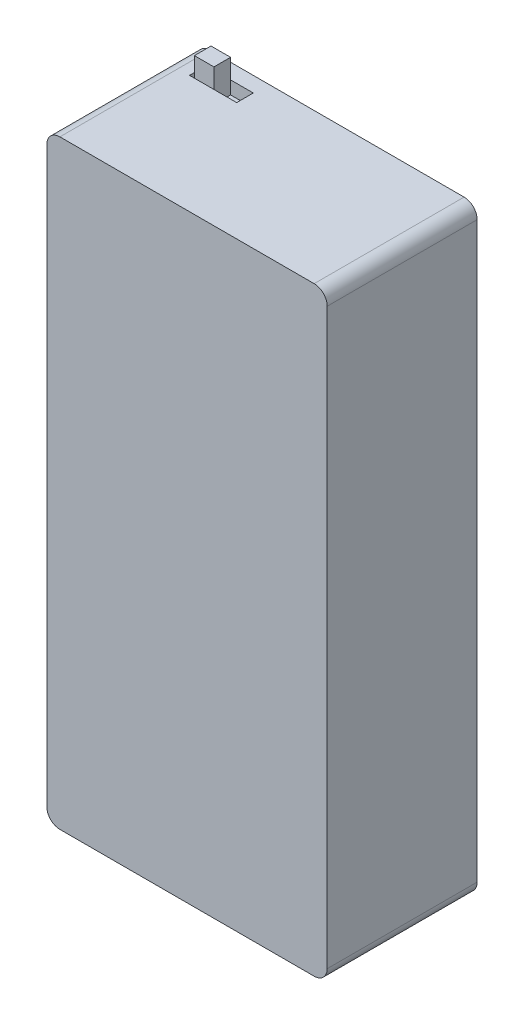
ISO-10303-21;
HEADER;
FILE_DESCRIPTION(('STEP AP214'),'2;1');
FILE_NAME('part.step','',(''),(''),'','','');
FILE_SCHEMA(('AUTOMOTIVE_DESIGN { 1 0 10303 214 1 1 1 1 }'));
ENDSEC;
DATA;
#1=APPLICATION_CONTEXT('core data for automotive mechanical design processes');
#2=APPLICATION_PROTOCOL_DEFINITION('international standard','automotive_design',2000,#1);
#3=PRODUCT_CONTEXT('',#1,'mechanical');
#4=PRODUCT('Part','Part','',(#3));
#5=PRODUCT_RELATED_PRODUCT_CATEGORY('part','',(#4));
#6=PRODUCT_DEFINITION_FORMATION('','',#4);
#7=PRODUCT_DEFINITION_CONTEXT('part definition',#1,'design');
#8=PRODUCT_DEFINITION('design','',#6,#7);
#9=PRODUCT_DEFINITION_SHAPE('','',#8);
#10=(LENGTH_UNIT() NAMED_UNIT(*) SI_UNIT(.MILLI.,.METRE.));
#11=(NAMED_UNIT(*) PLANE_ANGLE_UNIT() SI_UNIT($,.RADIAN.));
#12=(NAMED_UNIT(*) SI_UNIT($,.STERADIAN.) SOLID_ANGLE_UNIT());
#13=UNCERTAINTY_MEASURE_WITH_UNIT(LENGTH_MEASURE(1.E-05),#10,'distance_accuracy_value','');
#14=(GEOMETRIC_REPRESENTATION_CONTEXT(3) GLOBAL_UNCERTAINTY_ASSIGNED_CONTEXT((#13)) GLOBAL_UNIT_ASSIGNED_CONTEXT((#10,
#11,#12)) REPRESENTATION_CONTEXT('',''));
#15=CARTESIAN_POINT('',(0.,0.,0.));
#16=DIRECTION('',(0.,0.,1.));
#17=DIRECTION('',(1.,0.,0.));
#18=AXIS2_PLACEMENT_3D('',#15,#16,#17);
#19=CARTESIAN_POINT('',(3.77161647749301,90.,2.34243370889559));
#20=DIRECTION('',(0.,0.,-1.));
#21=DIRECTION('',(-1.,0.,0.));
#22=AXIS2_PLACEMENT_3D('',#19,#20,#21);
#23=PLANE('',#22);
#24=DIRECTION('',(0.,-1.,0.));
#25=VECTOR('',#24,1.);
#26=CARTESIAN_POINT('',(4.5196674747469,95.,2.34243370889559));
#27=LINE('',#26,#25);
#28=CARTESIAN_POINT('',(4.5196674747469,92.,2.34243370889559));
#29=VERTEX_POINT('',#28);
#30=CARTESIAN_POINT('',(4.5196674747469,90.,2.34243370889559));
#31=VERTEX_POINT('',#30);
#32=EDGE_CURVE('E533',#29,#31,#27,.T.);
#33=ORIENTED_EDGE('',*,*,#32,.F.);
#34=DIRECTION('',(-1.,0.,0.));
#35=VECTOR('',#34,1.);
#36=CARTESIAN_POINT('',(3.77161647749301,92.,2.34243370889559));
#37=LINE('',#36,#35);
#38=CARTESIAN_POINT('',(3.77161647749301,92.,2.34243370889559));
#39=VERTEX_POINT('',#38);
#40=EDGE_CURVE('E222',#29,#39,#37,.T.);
#41=ORIENTED_EDGE('',*,*,#40,.T.);
#42=DIRECTION('',(0.,1.,0.));
#43=VECTOR('',#42,1.);
#44=CARTESIAN_POINT('',(3.77161647749301,90.,2.34243370889559));
#45=LINE('',#44,#43);
#46=CARTESIAN_POINT('',(3.77161647749301,90.,2.34243370889559));
#47=VERTEX_POINT('',#46);
#48=EDGE_CURVE('E225',#47,#39,#45,.T.);
#49=ORIENTED_EDGE('',*,*,#48,.F.);
#50=DIRECTION('',(-1.,0.,0.));
#51=VECTOR('',#50,1.);
#52=CARTESIAN_POINT('',(3.77161647749301,90.,2.34243370889559));
#53=LINE('',#52,#51);
#54=EDGE_CURVE('E209',#31,#47,#53,.T.);
#55=ORIENTED_EDGE('',*,*,#54,.F.);
#56=EDGE_LOOP('',(#33,#41,#49,#55));
#57=FACE_BOUND('',#56,.T.);
#58=ADVANCED_FACE('F39',(#57),#23,.F.);
#59=DIRECTION('',(0.,-1.,0.));
#60=VECTOR('',#59,1.);
#61=CARTESIAN_POINT('',(7.5196674747469,95.,2.34243370889559));
#62=LINE('',#61,#60);
#63=CARTESIAN_POINT('',(7.5196674747469,92.,2.34243370889559));
#64=VERTEX_POINT('',#63);
#65=CARTESIAN_POINT('',(7.5196674747469,90.,2.34243370889559));
#66=VERTEX_POINT('',#65);
#67=EDGE_CURVE('E540',#64,#66,#62,.T.);
#68=ORIENTED_EDGE('',*,*,#67,.T.);
#69=CARTESIAN_POINT('',(11.0052712926965,90.,2.34243370889559));
#70=VERTEX_POINT('',#69);
#71=EDGE_CURVE('E210',#70,#66,#53,.T.);
#72=ORIENTED_EDGE('',*,*,#71,.F.);
#73=DIRECTION('',(0.,1.,0.));
#74=VECTOR('',#73,1.);
#75=CARTESIAN_POINT('',(11.0052712926965,90.,2.34243370889559));
#76=LINE('',#75,#74);
#77=CARTESIAN_POINT('',(11.0052712926965,92.,2.34243370889559));
#78=VERTEX_POINT('',#77);
#79=EDGE_CURVE('E228',#70,#78,#76,.T.);
#80=ORIENTED_EDGE('',*,*,#79,.T.);
#81=EDGE_CURVE('E202',#78,#64,#37,.T.);
#82=ORIENTED_EDGE('',*,*,#81,.T.);
#83=EDGE_LOOP('',(#68,#72,#80,#82));
#84=FACE_BOUND('',#83,.T.);
#85=ADVANCED_FACE('F335',(#84),#23,.F.);
#86=CARTESIAN_POINT('',(3.77161647749301,90.,4.89200056999192));
#87=DIRECTION('',(0.,0.,1.));
#88=DIRECTION('',(1.,0.,0.));
#89=AXIS2_PLACEMENT_3D('',#86,#87,#88);
#90=PLANE('',#89);
#91=DIRECTION('',(0.,-1.,0.));
#92=VECTOR('',#91,1.);
#93=CARTESIAN_POINT('',(4.5196674747469,95.,4.89200056999192));
#94=LINE('',#93,#92);
#95=CARTESIAN_POINT('',(4.5196674747469,92.,4.89200056999192));
#96=VERTEX_POINT('',#95);
#97=CARTESIAN_POINT('',(4.5196674747469,90.,4.89200056999192));
#98=VERTEX_POINT('',#97);
#99=EDGE_CURVE('E189',#96,#98,#94,.T.);
#100=ORIENTED_EDGE('',*,*,#99,.T.);
#101=DIRECTION('',(1.,0.,0.));
#102=VECTOR('',#101,1.);
#103=CARTESIAN_POINT('',(3.77161647749301,90.,4.89200056999192));
#104=LINE('',#103,#102);
#105=CARTESIAN_POINT('',(3.77161647749301,90.,4.89200056999192));
#106=VERTEX_POINT('',#105);
#107=EDGE_CURVE('E203',#106,#98,#104,.T.);
#108=ORIENTED_EDGE('',*,*,#107,.F.);
#109=DIRECTION('',(0.,1.,0.));
#110=VECTOR('',#109,1.);
#111=CARTESIAN_POINT('',(3.77161647749301,90.,4.89200056999192));
#112=LINE('',#111,#110);
#113=CARTESIAN_POINT('',(3.77161647749301,92.,4.89200056999192));
#114=VERTEX_POINT('',#113);
#115=EDGE_CURVE('E213',#106,#114,#112,.T.);
#116=ORIENTED_EDGE('',*,*,#115,.T.);
#117=DIRECTION('',(1.,0.,0.));
#118=VECTOR('',#117,1.);
#119=CARTESIAN_POINT('',(3.77161647749301,92.,4.89200056999192));
#120=LINE('',#119,#118);
#121=EDGE_CURVE('E216',#114,#96,#120,.T.);
#122=ORIENTED_EDGE('',*,*,#121,.T.);
#123=EDGE_LOOP('',(#100,#108,#116,#122));
#124=FACE_BOUND('',#123,.T.);
#125=ADVANCED_FACE('F341',(#124),#90,.F.);
#126=DIRECTION('',(0.,-1.,0.));
#127=VECTOR('',#126,1.);
#128=CARTESIAN_POINT('',(7.5196674747469,95.,4.89200056999192));
#129=LINE('',#128,#127);
#130=CARTESIAN_POINT('',(7.5196674747469,92.,4.89200056999192));
#131=VERTEX_POINT('',#130);
#132=CARTESIAN_POINT('',(7.5196674747469,90.,4.89200056999192));
#133=VERTEX_POINT('',#132);
#134=EDGE_CURVE('E54',#131,#133,#129,.T.);
#135=ORIENTED_EDGE('',*,*,#134,.F.);
#136=CARTESIAN_POINT('',(11.0052712926965,92.,4.89200056999192));
#137=VERTEX_POINT('',#136);
#138=EDGE_CURVE('E215',#131,#137,#120,.T.);
#139=ORIENTED_EDGE('',*,*,#138,.T.);
#140=DIRECTION('',(0.,1.,0.));
#141=VECTOR('',#140,1.);
#142=CARTESIAN_POINT('',(11.0052712926965,90.,4.89200056999192));
#143=LINE('',#142,#141);
#144=CARTESIAN_POINT('',(11.0052712926965,90.,4.89200056999192));
#145=VERTEX_POINT('',#144);
#146=EDGE_CURVE('E230',#145,#137,#143,.T.);
#147=ORIENTED_EDGE('',*,*,#146,.F.);
#148=EDGE_CURVE('E201',#133,#145,#104,.T.);
#149=ORIENTED_EDGE('',*,*,#148,.F.);
#150=EDGE_LOOP('',(#135,#139,#147,#149));
#151=FACE_BOUND('',#150,.T.);
#152=ADVANCED_FACE('F355',(#151),#90,.F.);
#153=CARTESIAN_POINT('',(0.,90.,0.));
#154=DIRECTION('',(0.,1.,0.));
#155=DIRECTION('',(0.,0.,1.));
#156=AXIS2_PLACEMENT_3D('',#153,#154,#155);
#157=PLANE('',#156);
#158=ORIENTED_EDGE('',*,*,#107,.T.);
#159=DIRECTION('',(0.,0.,1.));
#160=VECTOR('',#159,1.);
#161=CARTESIAN_POINT('',(4.5196674747469,90.,2.34243370889559));
#162=LINE('',#161,#160);
#163=EDGE_CURVE('E532',#31,#98,#162,.T.);
#164=ORIENTED_EDGE('',*,*,#163,.F.);
#165=ORIENTED_EDGE('',*,*,#54,.T.);
#166=DIRECTION('',(0.,0.,1.));
#167=VECTOR('',#166,1.);
#168=CARTESIAN_POINT('',(3.77161647749301,90.,2.34243370889559));
#169=LINE('',#168,#167);
#170=EDGE_CURVE('E198',#47,#106,#169,.T.);
#171=ORIENTED_EDGE('',*,*,#170,.T.);
#172=EDGE_LOOP('',(#158,#164,#165,#171));
#173=FACE_BOUND('',#172,.T.);
#174=ADVANCED_FACE('F346',(#173),#157,.T.);
#175=ORIENTED_EDGE('',*,*,#71,.T.);
#176=DIRECTION('',(0.,0.,-1.));
#177=VECTOR('',#176,1.);
#178=CARTESIAN_POINT('',(7.5196674747469,90.,2.34243370889559));
#179=LINE('',#178,#177);
#180=EDGE_CURVE('E185',#133,#66,#179,.T.);
#181=ORIENTED_EDGE('',*,*,#180,.F.);
#182=ORIENTED_EDGE('',*,*,#148,.T.);
#183=DIRECTION('',(0.,0.,-1.));
#184=VECTOR('',#183,1.);
#185=CARTESIAN_POINT('',(11.0052712926965,90.,2.34243370889559));
#186=LINE('',#185,#184);
#187=EDGE_CURVE('E206',#145,#70,#186,.T.);
#188=ORIENTED_EDGE('',*,*,#187,.T.);
#189=EDGE_LOOP('',(#175,#181,#182,#188));
#190=FACE_BOUND('',#189,.T.);
#191=ADVANCED_FACE('F456',(#190),#157,.T.);
#192=CARTESIAN_POINT('',(41.,2.,23.));
#193=DIRECTION('',(0.,0.,-1.));
#194=DIRECTION('',(-1.,0.,0.));
#195=AXIS2_PLACEMENT_3D('',#192,#193,#194);
#196=CYLINDRICAL_SURFACE('',#195,2.);
#197=CARTESIAN_POINT('',(41.,2.,0.));
#198=DIRECTION('',(0.,0.,1.));
#199=DIRECTION('',(-1.,0.,0.));
#200=AXIS2_PLACEMENT_3D('',#197,#198,#199);
#201=CIRCLE('',#200,2.);
#202=CARTESIAN_POINT('',(41.,0.,0.));
#203=VERTEX_POINT('',#202);
#204=CARTESIAN_POINT('',(43.,2.00000000000001,0.));
#205=VERTEX_POINT('',#204);
#206=EDGE_CURVE('E227',#203,#205,#201,.T.);
#207=ORIENTED_EDGE('',*,*,#206,.T.);
#208=DIRECTION('',(0.,0.,-1.));
#209=VECTOR('',#208,1.);
#210=CARTESIAN_POINT('',(43.,2.00000000000001,23.));
#211=LINE('',#210,#209);
#212=CARTESIAN_POINT('',(43.,2.00000000000001,23.));
#213=VERTEX_POINT('',#212);
#214=EDGE_CURVE('E11',#213,#205,#211,.T.);
#215=ORIENTED_EDGE('',*,*,#214,.F.);
#216=CARTESIAN_POINT('',(41.,2.,23.));
#217=DIRECTION('',(0.,0.,1.));
#218=DIRECTION('',(-1.,0.,0.));
#219=AXIS2_PLACEMENT_3D('',#216,#217,#218);
#220=CIRCLE('',#219,2.);
#221=CARTESIAN_POINT('',(41.,0.,23.));
#222=VERTEX_POINT('',#221);
#223=EDGE_CURVE('E234',#222,#213,#220,.T.);
#224=ORIENTED_EDGE('',*,*,#223,.F.);
#225=DIRECTION('',(0.,0.,-1.));
#226=VECTOR('',#225,1.);
#227=CARTESIAN_POINT('',(41.,0.,23.));
#228=LINE('',#227,#226);
#229=EDGE_CURVE('E252',#222,#203,#228,.T.);
#230=ORIENTED_EDGE('',*,*,#229,.T.);
#231=EDGE_LOOP('',(#207,#215,#224,#230));
#232=FACE_BOUND('',#231,.T.);
#233=ADVANCED_FACE('F41',(#232),#196,.T.);
#234=CARTESIAN_POINT('',(43.,2.00000000000001,23.));
#235=DIRECTION('',(-1.,0.,0.));
#236=DIRECTION('',(0.,0.,1.));
#237=AXIS2_PLACEMENT_3D('',#234,#235,#236);
#238=PLANE('',#237);
#239=DIRECTION('',(0.,1.,0.));
#240=VECTOR('',#239,1.);
#241=CARTESIAN_POINT('',(43.,2.00000000000001,0.));
#242=LINE('',#241,#240);
#243=CARTESIAN_POINT('',(43.,90.,0.));
#244=VERTEX_POINT('',#243);
#245=EDGE_CURVE('E255',#205,#244,#242,.T.);
#246=ORIENTED_EDGE('',*,*,#245,.T.);
#247=DIRECTION('',(0.,0.,-1.));
#248=VECTOR('',#247,1.);
#249=CARTESIAN_POINT('',(43.,90.,23.));
#250=LINE('',#249,#248);
#251=CARTESIAN_POINT('',(43.,90.,23.));
#252=VERTEX_POINT('',#251);
#253=EDGE_CURVE('E47',#252,#244,#250,.T.);
#254=ORIENTED_EDGE('',*,*,#253,.F.);
#255=DIRECTION('',(0.,1.,0.));
#256=VECTOR('',#255,1.);
#257=CARTESIAN_POINT('',(43.,2.00000000000001,23.));
#258=LINE('',#257,#256);
#259=EDGE_CURVE('E237',#213,#252,#258,.T.);
#260=ORIENTED_EDGE('',*,*,#259,.F.);
#261=ORIENTED_EDGE('',*,*,#214,.T.);
#262=EDGE_LOOP('',(#246,#254,#260,#261));
#263=FACE_BOUND('',#262,.T.);
#264=ADVANCED_FACE('F312',(#263),#238,.F.);
#265=CARTESIAN_POINT('',(41.,90.,23.));
#266=DIRECTION('',(0.,0.,-1.));
#267=DIRECTION('',(-1.,0.,0.));
#268=AXIS2_PLACEMENT_3D('',#265,#266,#267);
#269=CYLINDRICAL_SURFACE('',#268,2.);
#270=CARTESIAN_POINT('',(41.,90.,0.));
#271=DIRECTION('',(0.,0.,1.));
#272=DIRECTION('',(1.,0.,0.));
#273=AXIS2_PLACEMENT_3D('',#270,#271,#272);
#274=CIRCLE('',#273,2.);
#275=CARTESIAN_POINT('',(41.,92.,0.));
#276=VERTEX_POINT('',#275);
#277=EDGE_CURVE('E257',#244,#276,#274,.T.);
#278=ORIENTED_EDGE('',*,*,#277,.T.);
#279=DIRECTION('',(0.,0.,-1.));
#280=VECTOR('',#279,1.);
#281=CARTESIAN_POINT('',(41.,92.,23.));
#282=LINE('',#281,#280);
#283=CARTESIAN_POINT('',(41.,92.,23.));
#284=VERTEX_POINT('',#283);
#285=EDGE_CURVE('E282',#284,#276,#282,.T.);
#286=ORIENTED_EDGE('',*,*,#285,.F.);
#287=CARTESIAN_POINT('',(41.,90.,23.));
#288=DIRECTION('',(0.,0.,1.));
#289=DIRECTION('',(1.,0.,0.));
#290=AXIS2_PLACEMENT_3D('',#287,#288,#289);
#291=CIRCLE('',#290,2.);
#292=EDGE_CURVE('E240',#252,#284,#291,.T.);
#293=ORIENTED_EDGE('',*,*,#292,.F.);
#294=ORIENTED_EDGE('',*,*,#253,.T.);
#295=EDGE_LOOP('',(#278,#286,#293,#294));
#296=FACE_BOUND('',#295,.T.);
#297=ADVANCED_FACE('F289',(#296),#269,.T.);
#298=CARTESIAN_POINT('',(2.00000000000001,92.,23.));
#299=DIRECTION('',(0.,-1.,0.));
#300=DIRECTION('',(0.,0.,-1.));
#301=AXIS2_PLACEMENT_3D('',#298,#299,#300);
#302=PLANE('',#301);
#303=ORIENTED_EDGE('',*,*,#121,.F.);
#304=DIRECTION('',(0.,0.,1.));
#305=VECTOR('',#304,1.);
#306=CARTESIAN_POINT('',(3.77161647749301,92.,2.34243370889559));
#307=LINE('',#306,#305);
#308=EDGE_CURVE('E62',#39,#114,#307,.T.);
#309=ORIENTED_EDGE('',*,*,#308,.F.);
#310=ORIENTED_EDGE('',*,*,#40,.F.);
#311=DIRECTION('',(-1.,0.,0.));
#312=VECTOR('',#311,1.);
#313=CARTESIAN_POINT('',(2.00000000000001,92.,2.34243370889559));
#314=LINE('',#313,#312);
#315=EDGE_CURVE('E190',#64,#29,#314,.T.);
#316=ORIENTED_EDGE('',*,*,#315,.F.);
#317=ORIENTED_EDGE('',*,*,#81,.F.);
#318=DIRECTION('',(0.,0.,-1.));
#319=VECTOR('',#318,1.);
#320=CARTESIAN_POINT('',(11.0052712926965,92.,2.34243370889559));
#321=LINE('',#320,#319);
#322=EDGE_CURVE('E219',#137,#78,#321,.T.);
#323=ORIENTED_EDGE('',*,*,#322,.F.);
#324=ORIENTED_EDGE('',*,*,#138,.F.);
#325=DIRECTION('',(1.,0.,0.));
#326=VECTOR('',#325,1.);
#327=CARTESIAN_POINT('',(2.00000000000001,92.,4.89200056999192));
#328=LINE('',#327,#326);
#329=EDGE_CURVE('E192',#96,#131,#328,.T.);
#330=ORIENTED_EDGE('',*,*,#329,.F.);
#331=EDGE_LOOP('',(#303,#309,#310,#316,#317,#323,#324,#330));
#332=FACE_BOUND('',#331,.T.);
#333=DIRECTION('',(-1.,0.,0.));
#334=VECTOR('',#333,1.);
#335=CARTESIAN_POINT('',(2.00000000000001,92.,0.));
#336=LINE('',#335,#334);
#337=CARTESIAN_POINT('',(2.00000000000001,92.,0.));
#338=VERTEX_POINT('',#337);
#339=EDGE_CURVE('E259',#276,#338,#336,.T.);
#340=ORIENTED_EDGE('',*,*,#339,.T.);
#341=DIRECTION('',(0.,0.,-1.));
#342=VECTOR('',#341,1.);
#343=CARTESIAN_POINT('',(2.00000000000001,92.,23.));
#344=LINE('',#343,#342);
#345=CARTESIAN_POINT('',(2.00000000000001,92.,23.));
#346=VERTEX_POINT('',#345);
#347=EDGE_CURVE('E279',#346,#338,#344,.T.);
#348=ORIENTED_EDGE('',*,*,#347,.F.);
#349=DIRECTION('',(-1.,0.,0.));
#350=VECTOR('',#349,1.);
#351=CARTESIAN_POINT('',(2.00000000000001,92.,23.));
#352=LINE('',#351,#350);
#353=EDGE_CURVE('E242',#284,#346,#352,.T.);
#354=ORIENTED_EDGE('',*,*,#353,.F.);
#355=ORIENTED_EDGE('',*,*,#285,.T.);
#356=EDGE_LOOP('',(#340,#348,#354,#355));
#357=FACE_BOUND('',#356,.T.);
#358=ADVANCED_FACE('F300',(#332,#357),#302,.F.);
#359=CARTESIAN_POINT('',(2.,90.,23.));
#360=DIRECTION('',(0.,0.,-1.));
#361=DIRECTION('',(-1.,0.,0.));
#362=AXIS2_PLACEMENT_3D('',#359,#360,#361);
#363=CYLINDRICAL_SURFACE('',#362,2.);
#364=CARTESIAN_POINT('',(2.,90.,0.));
#365=DIRECTION('',(0.,0.,1.));
#366=DIRECTION('',(-1.,0.,0.));
#367=AXIS2_PLACEMENT_3D('',#364,#365,#366);
#368=CIRCLE('',#367,2.);
#369=CARTESIAN_POINT('',(0.,90.,0.));
#370=VERTEX_POINT('',#369);
#371=EDGE_CURVE('E261',#338,#370,#368,.T.);
#372=ORIENTED_EDGE('',*,*,#371,.T.);
#373=DIRECTION('',(0.,0.,-1.));
#374=VECTOR('',#373,1.);
#375=CARTESIAN_POINT('',(0.,90.,23.));
#376=LINE('',#375,#374);
#377=CARTESIAN_POINT('',(0.,90.,23.));
#378=VERTEX_POINT('',#377);
#379=EDGE_CURVE('E276',#378,#370,#376,.T.);
#380=ORIENTED_EDGE('',*,*,#379,.F.);
#381=CARTESIAN_POINT('',(2.,90.,23.));
#382=DIRECTION('',(0.,0.,1.));
#383=DIRECTION('',(-1.,0.,0.));
#384=AXIS2_PLACEMENT_3D('',#381,#382,#383);
#385=CIRCLE('',#384,2.);
#386=EDGE_CURVE('E244',#346,#378,#385,.T.);
#387=ORIENTED_EDGE('',*,*,#386,.F.);
#388=ORIENTED_EDGE('',*,*,#347,.T.);
#389=EDGE_LOOP('',(#372,#380,#387,#388));
#390=FACE_BOUND('',#389,.T.);
#391=ADVANCED_FACE('F304',(#390),#363,.T.);
#392=CARTESIAN_POINT('',(0.,2.00000000000001,23.));
#393=DIRECTION('',(1.,0.,0.));
#394=DIRECTION('',(0.,0.,-1.));
#395=AXIS2_PLACEMENT_3D('',#392,#393,#394);
#396=PLANE('',#395);
#397=DIRECTION('',(0.,-1.,0.));
#398=VECTOR('',#397,1.);
#399=CARTESIAN_POINT('',(0.,2.00000000000001,0.));
#400=LINE('',#399,#398);
#401=CARTESIAN_POINT('',(0.,2.00000000000001,0.));
#402=VERTEX_POINT('',#401);
#403=EDGE_CURVE('E263',#370,#402,#400,.T.);
#404=ORIENTED_EDGE('',*,*,#403,.T.);
#405=DIRECTION('',(0.,0.,-1.));
#406=VECTOR('',#405,1.);
#407=CARTESIAN_POINT('',(0.,2.00000000000001,23.));
#408=LINE('',#407,#406);
#409=CARTESIAN_POINT('',(0.,2.00000000000001,23.));
#410=VERTEX_POINT('',#409);
#411=EDGE_CURVE('E273',#410,#402,#408,.T.);
#412=ORIENTED_EDGE('',*,*,#411,.F.);
#413=DIRECTION('',(0.,-1.,0.));
#414=VECTOR('',#413,1.);
#415=CARTESIAN_POINT('',(0.,2.00000000000001,23.));
#416=LINE('',#415,#414);
#417=EDGE_CURVE('E246',#378,#410,#416,.T.);
#418=ORIENTED_EDGE('',*,*,#417,.F.);
#419=ORIENTED_EDGE('',*,*,#379,.T.);
#420=EDGE_LOOP('',(#404,#412,#418,#419));
#421=FACE_BOUND('',#420,.T.);
#422=ADVANCED_FACE('F325',(#421),#396,.F.);
#423=CARTESIAN_POINT('',(2.,2.,23.));
#424=DIRECTION('',(0.,0.,-1.));
#425=DIRECTION('',(-1.,0.,0.));
#426=AXIS2_PLACEMENT_3D('',#423,#424,#425);
#427=CYLINDRICAL_SURFACE('',#426,2.);
#428=CARTESIAN_POINT('',(2.,2.,0.));
#429=DIRECTION('',(0.,0.,1.));
#430=DIRECTION('',(1.,0.,0.));
#431=AXIS2_PLACEMENT_3D('',#428,#429,#430);
#432=CIRCLE('',#431,2.);
#433=CARTESIAN_POINT('',(2.00000000000001,0.,0.));
#434=VERTEX_POINT('',#433);
#435=EDGE_CURVE('E265',#402,#434,#432,.T.);
#436=ORIENTED_EDGE('',*,*,#435,.T.);
#437=DIRECTION('',(0.,0.,-1.));
#438=VECTOR('',#437,1.);
#439=CARTESIAN_POINT('',(2.00000000000001,0.,23.));
#440=LINE('',#439,#438);
#441=CARTESIAN_POINT('',(2.00000000000001,0.,23.));
#442=VERTEX_POINT('',#441);
#443=EDGE_CURVE('E270',#442,#434,#440,.T.);
#444=ORIENTED_EDGE('',*,*,#443,.F.);
#445=CARTESIAN_POINT('',(2.,2.,23.));
#446=DIRECTION('',(0.,0.,1.));
#447=DIRECTION('',(1.,0.,0.));
#448=AXIS2_PLACEMENT_3D('',#445,#446,#447);
#449=CIRCLE('',#448,2.);
#450=EDGE_CURVE('E248',#410,#442,#449,.T.);
#451=ORIENTED_EDGE('',*,*,#450,.F.);
#452=ORIENTED_EDGE('',*,*,#411,.T.);
#453=EDGE_LOOP('',(#436,#444,#451,#452));
#454=FACE_BOUND('',#453,.T.);
#455=ADVANCED_FACE('F323',(#454),#427,.T.);
#456=CARTESIAN_POINT('',(2.00000000000001,0.,23.));
#457=DIRECTION('',(0.,1.,0.));
#458=DIRECTION('',(0.,0.,1.));
#459=AXIS2_PLACEMENT_3D('',#456,#457,#458);
#460=PLANE('',#459);
#461=DIRECTION('',(1.,0.,0.));
#462=VECTOR('',#461,1.);
#463=CARTESIAN_POINT('',(2.00000000000001,0.,0.));
#464=LINE('',#463,#462);
#465=EDGE_CURVE('E238',#434,#203,#464,.T.);
#466=ORIENTED_EDGE('',*,*,#465,.T.);
#467=ORIENTED_EDGE('',*,*,#229,.F.);
#468=DIRECTION('',(1.,0.,0.));
#469=VECTOR('',#468,1.);
#470=CARTESIAN_POINT('',(2.00000000000001,0.,23.));
#471=LINE('',#470,#469);
#472=EDGE_CURVE('E250',#442,#222,#471,.T.);
#473=ORIENTED_EDGE('',*,*,#472,.F.);
#474=ORIENTED_EDGE('',*,*,#443,.T.);
#475=EDGE_LOOP('',(#466,#467,#473,#474));
#476=FACE_BOUND('',#475,.T.);
#477=ADVANCED_FACE('F318',(#476),#460,.F.);
#478=CARTESIAN_POINT('',(41.,2.,23.));
#479=DIRECTION('',(0.,0.,-1.));
#480=DIRECTION('',(-1.,0.,0.));
#481=AXIS2_PLACEMENT_3D('',#478,#479,#480);
#482=PLANE('',#481);
#483=ORIENTED_EDGE('',*,*,#223,.T.);
#484=ORIENTED_EDGE('',*,*,#259,.T.);
#485=ORIENTED_EDGE('',*,*,#292,.T.);
#486=ORIENTED_EDGE('',*,*,#353,.T.);
#487=ORIENTED_EDGE('',*,*,#386,.T.);
#488=ORIENTED_EDGE('',*,*,#417,.T.);
#489=ORIENTED_EDGE('',*,*,#450,.T.);
#490=ORIENTED_EDGE('',*,*,#472,.T.);
#491=EDGE_LOOP('',(#483,#484,#485,#486,#487,#488,#489,#490));
#492=FACE_BOUND('',#491,.T.);
#493=ADVANCED_FACE('F308',(#492),#482,.F.);
#494=CARTESIAN_POINT('',(41.,2.,0.));
#495=DIRECTION('',(0.,0.,-1.));
#496=DIRECTION('',(-1.,0.,0.));
#497=AXIS2_PLACEMENT_3D('',#494,#495,#496);
#498=PLANE('',#497);
#499=ORIENTED_EDGE('',*,*,#206,.F.);
#500=ORIENTED_EDGE('',*,*,#465,.F.);
#501=ORIENTED_EDGE('',*,*,#435,.F.);
#502=ORIENTED_EDGE('',*,*,#403,.F.);
#503=ORIENTED_EDGE('',*,*,#371,.F.);
#504=ORIENTED_EDGE('',*,*,#339,.F.);
#505=ORIENTED_EDGE('',*,*,#277,.F.);
#506=ORIENTED_EDGE('',*,*,#245,.F.);
#507=EDGE_LOOP('',(#499,#500,#501,#502,#503,#504,#505,#506));
#508=FACE_BOUND('',#507,.T.);
#509=ADVANCED_FACE('F295',(#508),#498,.T.);
#510=CARTESIAN_POINT('',(3.77161647749301,90.,2.34243370889559));
#511=DIRECTION('',(-1.,0.,0.));
#512=DIRECTION('',(0.,0.,1.));
#513=AXIS2_PLACEMENT_3D('',#510,#511,#512);
#514=PLANE('',#513);
#515=ORIENTED_EDGE('',*,*,#308,.T.);
#516=ORIENTED_EDGE('',*,*,#115,.F.);
#517=ORIENTED_EDGE('',*,*,#170,.F.);
#518=ORIENTED_EDGE('',*,*,#48,.T.);
#519=EDGE_LOOP('',(#515,#516,#517,#518));
#520=FACE_BOUND('',#519,.T.);
#521=ADVANCED_FACE('F351',(#520),#514,.F.);
#522=CARTESIAN_POINT('',(11.0052712926965,90.,2.34243370889559));
#523=DIRECTION('',(1.,0.,0.));
#524=DIRECTION('',(0.,0.,-1.));
#525=AXIS2_PLACEMENT_3D('',#522,#523,#524);
#526=PLANE('',#525);
#527=ORIENTED_EDGE('',*,*,#322,.T.);
#528=ORIENTED_EDGE('',*,*,#79,.F.);
#529=ORIENTED_EDGE('',*,*,#187,.F.);
#530=ORIENTED_EDGE('',*,*,#146,.T.);
#531=EDGE_LOOP('',(#527,#528,#529,#530));
#532=FACE_BOUND('',#531,.T.);
#533=ADVANCED_FACE('F348',(#532),#526,.F.);
#534=CARTESIAN_POINT('',(4.5196674747469,95.,4.89200056999192));
#535=DIRECTION('',(0.,0.,-1.));
#536=DIRECTION('',(-1.,0.,0.));
#537=AXIS2_PLACEMENT_3D('',#534,#535,#536);
#538=PLANE('',#537);
#539=CARTESIAN_POINT('',(4.5196674747469,95.,4.89200056999192));
#540=VERTEX_POINT('',#539);
#541=EDGE_CURVE('E170',#540,#96,#94,.T.);
#542=ORIENTED_EDGE('',*,*,#541,.T.);
#543=ORIENTED_EDGE('',*,*,#329,.T.);
#544=CARTESIAN_POINT('',(7.5196674747469,95.,4.89200056999192));
#545=VERTEX_POINT('',#544);
#546=EDGE_CURVE('E172',#545,#131,#129,.T.);
#547=ORIENTED_EDGE('',*,*,#546,.F.);
#548=DIRECTION('',(1.,0.,0.));
#549=VECTOR('',#548,1.);
#550=CARTESIAN_POINT('',(4.5196674747469,95.,4.89200056999192));
#551=LINE('',#550,#549);
#552=EDGE_CURVE('E166',#540,#545,#551,.T.);
#553=ORIENTED_EDGE('',*,*,#552,.F.);
#554=EDGE_LOOP('',(#542,#543,#547,#553));
#555=FACE_BOUND('',#554,.T.);
#556=ADVANCED_FACE('F168',(#555),#538,.F.);
#557=CARTESIAN_POINT('',(4.5196674747469,95.,2.34243370889559));
#558=DIRECTION('',(0.,0.,1.));
#559=DIRECTION('',(1.,0.,0.));
#560=AXIS2_PLACEMENT_3D('',#557,#558,#559);
#561=PLANE('',#560);
#562=CARTESIAN_POINT('',(7.5196674747469,95.,2.34243370889559));
#563=VERTEX_POINT('',#562);
#564=EDGE_CURVE('E544',#563,#64,#62,.T.);
#565=ORIENTED_EDGE('',*,*,#564,.T.);
#566=ORIENTED_EDGE('',*,*,#315,.T.);
#567=CARTESIAN_POINT('',(4.5196674747469,95.,2.34243370889559));
#568=VERTEX_POINT('',#567);
#569=EDGE_CURVE('E546',#568,#29,#27,.T.);
#570=ORIENTED_EDGE('',*,*,#569,.F.);
#571=DIRECTION('',(-1.,0.,0.));
#572=VECTOR('',#571,1.);
#573=CARTESIAN_POINT('',(4.5196674747469,95.,2.34243370889559));
#574=LINE('',#573,#572);
#575=EDGE_CURVE('E181',#563,#568,#574,.T.);
#576=ORIENTED_EDGE('',*,*,#575,.F.);
#577=EDGE_LOOP('',(#565,#566,#570,#576));
#578=FACE_BOUND('',#577,.T.);
#579=ADVANCED_FACE('F390',(#578),#561,.F.);
#580=CARTESIAN_POINT('',(4.5196674747469,95.,2.34243370889559));
#581=DIRECTION('',(1.,0.,0.));
#582=DIRECTION('',(0.,0.,-1.));
#583=AXIS2_PLACEMENT_3D('',#580,#581,#582);
#584=PLANE('',#583);
#585=ORIENTED_EDGE('',*,*,#163,.T.);
#586=ORIENTED_EDGE('',*,*,#99,.F.);
#587=ORIENTED_EDGE('',*,*,#541,.F.);
#588=DIRECTION('',(0.,0.,1.));
#589=VECTOR('',#588,1.);
#590=CARTESIAN_POINT('',(4.5196674747469,95.,2.34243370889559));
#591=LINE('',#590,#589);
#592=EDGE_CURVE('E176',#568,#540,#591,.T.);
#593=ORIENTED_EDGE('',*,*,#592,.F.);
#594=ORIENTED_EDGE('',*,*,#569,.T.);
#595=ORIENTED_EDGE('',*,*,#32,.T.);
#596=EDGE_LOOP('',(#585,#586,#587,#593,#594,#595));
#597=FACE_BOUND('',#596,.T.);
#598=ADVANCED_FACE('F187',(#597),#584,.F.);
#599=CARTESIAN_POINT('',(7.5196674747469,95.,2.34243370889559));
#600=DIRECTION('',(-1.,0.,0.));
#601=DIRECTION('',(0.,0.,1.));
#602=AXIS2_PLACEMENT_3D('',#599,#600,#601);
#603=PLANE('',#602);
#604=ORIENTED_EDGE('',*,*,#180,.T.);
#605=ORIENTED_EDGE('',*,*,#67,.F.);
#606=ORIENTED_EDGE('',*,*,#564,.F.);
#607=DIRECTION('',(0.,0.,-1.));
#608=VECTOR('',#607,1.);
#609=CARTESIAN_POINT('',(7.5196674747469,95.,2.34243370889559));
#610=LINE('',#609,#608);
#611=EDGE_CURVE('E175',#545,#563,#610,.T.);
#612=ORIENTED_EDGE('',*,*,#611,.F.);
#613=ORIENTED_EDGE('',*,*,#546,.T.);
#614=ORIENTED_EDGE('',*,*,#134,.T.);
#615=EDGE_LOOP('',(#604,#605,#606,#612,#613,#614));
#616=FACE_BOUND('',#615,.T.);
#617=ADVANCED_FACE('F405',(#616),#603,.F.);
#618=CARTESIAN_POINT('',(0.,95.,0.));
#619=DIRECTION('',(0.,1.,0.));
#620=DIRECTION('',(0.,0.,1.));
#621=AXIS2_PLACEMENT_3D('',#618,#619,#620);
#622=PLANE('',#621);
#623=ORIENTED_EDGE('',*,*,#592,.T.);
#624=ORIENTED_EDGE('',*,*,#552,.T.);
#625=ORIENTED_EDGE('',*,*,#611,.T.);
#626=ORIENTED_EDGE('',*,*,#575,.T.);
#627=EDGE_LOOP('',(#623,#624,#625,#626));
#628=FACE_BOUND('',#627,.T.);
#629=ADVANCED_FACE('F179',(#628),#622,.T.);
#630=CLOSED_SHELL('',(#58,#85,#125,#152,#174,#191,#233,#264,#297,#358,#391,#422,#455,#477,#493,
#509,#521,#533,#556,#579,#598,#617,#629));
#631=MANIFOLD_SOLID_BREP('B2',#630);
#632=ADVANCED_BREP_SHAPE_REPRESENTATION('',(#18,#631),#14);
#633=SHAPE_DEFINITION_REPRESENTATION(#9,#632);
ENDSEC;
END-ISO-10303-21;
